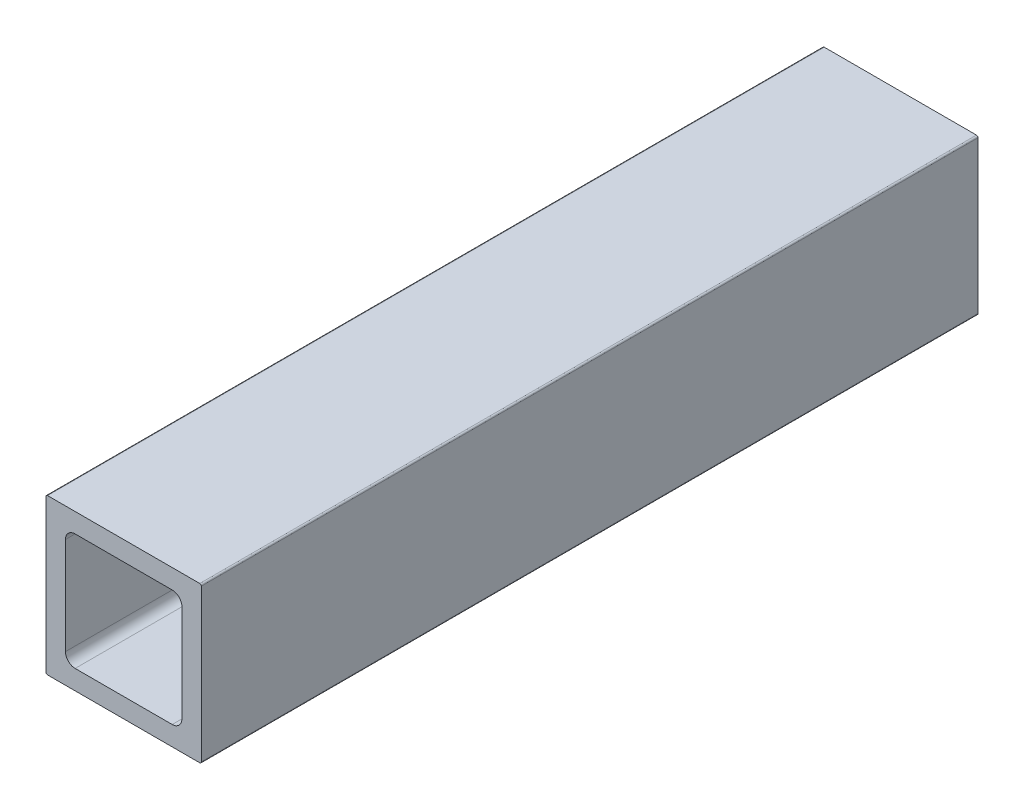
ISO-10303-21;
HEADER;
FILE_DESCRIPTION(('STEP AP214'),'2;1');
FILE_NAME('part.step','',(''),(''),'','','');
FILE_SCHEMA(('AUTOMOTIVE_DESIGN { 1 0 10303 214 1 1 1 1 }'));
ENDSEC;
DATA;
#1=APPLICATION_CONTEXT('core data for automotive mechanical design processes');
#2=APPLICATION_PROTOCOL_DEFINITION('international standard','automotive_design',2000,#1);
#3=PRODUCT_CONTEXT('',#1,'mechanical');
#4=PRODUCT('Part','Part','',(#3));
#5=PRODUCT_RELATED_PRODUCT_CATEGORY('part','',(#4));
#6=PRODUCT_DEFINITION_FORMATION('','',#4);
#7=PRODUCT_DEFINITION_CONTEXT('part definition',#1,'design');
#8=PRODUCT_DEFINITION('design','',#6,#7);
#9=PRODUCT_DEFINITION_SHAPE('','',#8);
#10=(LENGTH_UNIT() NAMED_UNIT(*) SI_UNIT(.MILLI.,.METRE.));
#11=(NAMED_UNIT(*) PLANE_ANGLE_UNIT() SI_UNIT($,.RADIAN.));
#12=(NAMED_UNIT(*) SI_UNIT($,.STERADIAN.) SOLID_ANGLE_UNIT());
#13=UNCERTAINTY_MEASURE_WITH_UNIT(LENGTH_MEASURE(1.E-05),#10,'distance_accuracy_value','');
#14=(GEOMETRIC_REPRESENTATION_CONTEXT(3) GLOBAL_UNCERTAINTY_ASSIGNED_CONTEXT((#13)) GLOBAL_UNIT_ASSIGNED_CONTEXT((#10,
#11,#12)) REPRESENTATION_CONTEXT('',''));
#15=CARTESIAN_POINT('',(0.,0.,0.));
#16=DIRECTION('',(0.,0.,1.));
#17=DIRECTION('',(1.,0.,0.));
#18=AXIS2_PLACEMENT_3D('',#15,#16,#17);
#19=CARTESIAN_POINT('',(3.175,4.7625,1828.8));
#20=DIRECTION('',(1.,0.,0.));
#21=DIRECTION('',(0.,1.,0.));
#22=AXIS2_PLACEMENT_3D('',#19,#20,#21);
#23=PLANE('',#22);
#24=DIRECTION('',(0.,-1.,0.));
#25=VECTOR('',#24,1.);
#26=CARTESIAN_POINT('',(3.175,4.7625,1701.8));
#27=LINE('',#26,#25);
#28=CARTESIAN_POINT('',(3.175,20.6375,1701.8));
#29=VERTEX_POINT('',#28);
#30=CARTESIAN_POINT('',(3.175,4.7625,1701.8));
#31=VERTEX_POINT('',#30);
#32=EDGE_CURVE('E55',#29,#31,#27,.T.);
#33=ORIENTED_EDGE('',*,*,#32,.F.);
#34=DIRECTION('',(0.,0.,-1.));
#35=VECTOR('',#34,1.);
#36=CARTESIAN_POINT('',(3.175,20.6375,1828.8));
#37=LINE('',#36,#35);
#38=CARTESIAN_POINT('',(3.175,20.6375,1828.8));
#39=VERTEX_POINT('',#38);
#40=EDGE_CURVE('E48',#39,#29,#37,.T.);
#41=ORIENTED_EDGE('',*,*,#40,.F.);
#42=DIRECTION('',(0.,-1.,0.));
#43=VECTOR('',#42,1.);
#44=CARTESIAN_POINT('',(3.175,4.7625,1828.8));
#45=LINE('',#44,#43);
#46=CARTESIAN_POINT('',(3.175,4.7625,1828.8));
#47=VERTEX_POINT('',#46);
#48=EDGE_CURVE('E214',#39,#47,#45,.T.);
#49=ORIENTED_EDGE('',*,*,#48,.T.);
#50=DIRECTION('',(0.,0.,-1.));
#51=VECTOR('',#50,1.);
#52=CARTESIAN_POINT('',(3.175,4.7625,1828.8));
#53=LINE('',#52,#51);
#54=EDGE_CURVE('E319',#47,#31,#53,.T.);
#55=ORIENTED_EDGE('',*,*,#54,.T.);
#56=EDGE_LOOP('',(#33,#41,#49,#55));
#57=FACE_BOUND('',#56,.T.);
#58=ADVANCED_FACE('F40',(#57),#23,.T.);
#59=CARTESIAN_POINT('',(4.7625,20.6375,1828.8));
#60=DIRECTION('',(0.,0.,-1.));
#61=DIRECTION('',(-1.,0.,0.));
#62=AXIS2_PLACEMENT_3D('',#59,#60,#61);
#63=CYLINDRICAL_SURFACE('',#62,1.5875);
#64=ORIENTED_EDGE('',*,*,#40,.T.);
#65=CARTESIAN_POINT('',(4.7625,20.6375,1701.8));
#66=DIRECTION('',(0.,0.,1.));
#67=DIRECTION('',(1.,0.,0.));
#68=AXIS2_PLACEMENT_3D('',#65,#66,#67);
#69=CIRCLE('',#68,1.5875);
#70=CARTESIAN_POINT('',(4.7625,22.225,1701.8));
#71=VERTEX_POINT('',#70);
#72=EDGE_CURVE('E299',#29,#71,#69,.F.);
#73=ORIENTED_EDGE('',*,*,#72,.T.);
#74=DIRECTION('',(0.,0.,-1.));
#75=VECTOR('',#74,1.);
#76=CARTESIAN_POINT('',(4.7625,22.225,1828.8));
#77=LINE('',#76,#75);
#78=CARTESIAN_POINT('',(4.7625,22.225,1828.8));
#79=VERTEX_POINT('',#78);
#80=EDGE_CURVE('E287',#79,#71,#77,.T.);
#81=ORIENTED_EDGE('',*,*,#80,.F.);
#82=CARTESIAN_POINT('',(4.7625,20.6375,1828.8));
#83=DIRECTION('',(0.,0.,1.));
#84=DIRECTION('',(-1.,0.,0.));
#85=AXIS2_PLACEMENT_3D('',#82,#83,#84);
#86=CIRCLE('',#85,1.5875);
#87=EDGE_CURVE('E219',#79,#39,#86,.T.);
#88=ORIENTED_EDGE('',*,*,#87,.T.);
#89=EDGE_LOOP('',(#64,#73,#81,#88));
#90=FACE_BOUND('',#89,.T.);
#91=ADVANCED_FACE('F297',(#90),#63,.F.);
#92=CARTESIAN_POINT('',(4.7625,22.225,1828.8));
#93=DIRECTION('',(0.,-1.,0.));
#94=DIRECTION('',(0.,0.,-1.));
#95=AXIS2_PLACEMENT_3D('',#92,#93,#94);
#96=PLANE('',#95);
#97=DIRECTION('',(-1.,0.,0.));
#98=VECTOR('',#97,1.);
#99=CARTESIAN_POINT('',(4.7625,22.225,1701.8));
#100=LINE('',#99,#98);
#101=CARTESIAN_POINT('',(20.6375,22.225,1701.8));
#102=VERTEX_POINT('',#101);
#103=EDGE_CURVE('E332',#102,#71,#100,.T.);
#104=ORIENTED_EDGE('',*,*,#103,.F.);
#105=DIRECTION('',(0.,0.,-1.));
#106=VECTOR('',#105,1.);
#107=CARTESIAN_POINT('',(20.6375,22.225,1828.8));
#108=LINE('',#107,#106);
#109=CARTESIAN_POINT('',(20.6375,22.225,1828.8));
#110=VERTEX_POINT('',#109);
#111=EDGE_CURVE('E234',#110,#102,#108,.T.);
#112=ORIENTED_EDGE('',*,*,#111,.F.);
#113=DIRECTION('',(-1.,0.,0.));
#114=VECTOR('',#113,1.);
#115=CARTESIAN_POINT('',(4.7625,22.225,1828.8));
#116=LINE('',#115,#114);
#117=EDGE_CURVE('E223',#110,#79,#116,.T.);
#118=ORIENTED_EDGE('',*,*,#117,.T.);
#119=ORIENTED_EDGE('',*,*,#80,.T.);
#120=EDGE_LOOP('',(#104,#112,#118,#119));
#121=FACE_BOUND('',#120,.T.);
#122=ADVANCED_FACE('F286',(#121),#96,.T.);
#123=CARTESIAN_POINT('',(20.6375,20.6375,1828.8));
#124=DIRECTION('',(0.,0.,-1.));
#125=DIRECTION('',(-1.,0.,0.));
#126=AXIS2_PLACEMENT_3D('',#123,#124,#125);
#127=CYLINDRICAL_SURFACE('',#126,1.5875);
#128=ORIENTED_EDGE('',*,*,#111,.T.);
#129=CARTESIAN_POINT('',(20.6375,20.6375,1701.8));
#130=DIRECTION('',(0.,0.,1.));
#131=DIRECTION('',(1.,0.,0.));
#132=AXIS2_PLACEMENT_3D('',#129,#130,#131);
#133=CIRCLE('',#132,1.5875);
#134=CARTESIAN_POINT('',(22.225,20.6375,1701.8));
#135=VERTEX_POINT('',#134);
#136=EDGE_CURVE('E334',#102,#135,#133,.F.);
#137=ORIENTED_EDGE('',*,*,#136,.T.);
#138=DIRECTION('',(0.,0.,-1.));
#139=VECTOR('',#138,1.);
#140=CARTESIAN_POINT('',(22.225,20.6375,1828.8));
#141=LINE('',#140,#139);
#142=CARTESIAN_POINT('',(22.225,20.6375,1828.8));
#143=VERTEX_POINT('',#142);
#144=EDGE_CURVE('E230',#143,#135,#141,.T.);
#145=ORIENTED_EDGE('',*,*,#144,.F.);
#146=CARTESIAN_POINT('',(20.6375,20.6375,1828.8));
#147=DIRECTION('',(0.,0.,1.));
#148=DIRECTION('',(-1.,0.,0.));
#149=AXIS2_PLACEMENT_3D('',#146,#147,#148);
#150=CIRCLE('',#149,1.5875);
#151=EDGE_CURVE('E209',#143,#110,#150,.T.);
#152=ORIENTED_EDGE('',*,*,#151,.T.);
#153=EDGE_LOOP('',(#128,#137,#145,#152));
#154=FACE_BOUND('',#153,.T.);
#155=ADVANCED_FACE('F489',(#154),#127,.F.);
#156=CARTESIAN_POINT('',(22.225,4.7625,1828.8));
#157=DIRECTION('',(-1.,0.,0.));
#158=DIRECTION('',(0.,0.,1.));
#159=AXIS2_PLACEMENT_3D('',#156,#157,#158);
#160=PLANE('',#159);
#161=DIRECTION('',(0.,1.,0.));
#162=VECTOR('',#161,1.);
#163=CARTESIAN_POINT('',(22.225,4.7625,1701.8));
#164=LINE('',#163,#162);
#165=CARTESIAN_POINT('',(22.225,4.7625,1701.8));
#166=VERTEX_POINT('',#165);
#167=EDGE_CURVE('E337',#166,#135,#164,.T.);
#168=ORIENTED_EDGE('',*,*,#167,.F.);
#169=DIRECTION('',(0.,0.,-1.));
#170=VECTOR('',#169,1.);
#171=CARTESIAN_POINT('',(22.225,4.7625,1828.8));
#172=LINE('',#171,#170);
#173=CARTESIAN_POINT('',(22.225,4.7625,1828.8));
#174=VERTEX_POINT('',#173);
#175=EDGE_CURVE('E235',#174,#166,#172,.T.);
#176=ORIENTED_EDGE('',*,*,#175,.F.);
#177=DIRECTION('',(0.,1.,0.));
#178=VECTOR('',#177,1.);
#179=CARTESIAN_POINT('',(22.225,4.7625,1828.8));
#180=LINE('',#179,#178);
#181=EDGE_CURVE('E205',#174,#143,#180,.T.);
#182=ORIENTED_EDGE('',*,*,#181,.T.);
#183=ORIENTED_EDGE('',*,*,#144,.T.);
#184=EDGE_LOOP('',(#168,#176,#182,#183));
#185=FACE_BOUND('',#184,.T.);
#186=ADVANCED_FACE('F388',(#185),#160,.T.);
#187=CARTESIAN_POINT('',(20.6375,4.7625,1828.8));
#188=DIRECTION('',(0.,0.,-1.));
#189=DIRECTION('',(-1.,0.,0.));
#190=AXIS2_PLACEMENT_3D('',#187,#188,#189);
#191=CYLINDRICAL_SURFACE('',#190,1.5875);
#192=ORIENTED_EDGE('',*,*,#175,.T.);
#193=CARTESIAN_POINT('',(20.6375,4.7625,1701.8));
#194=DIRECTION('',(0.,0.,1.));
#195=DIRECTION('',(1.,0.,0.));
#196=AXIS2_PLACEMENT_3D('',#193,#194,#195);
#197=CIRCLE('',#196,1.5875);
#198=CARTESIAN_POINT('',(20.6375,3.175,1701.8));
#199=VERTEX_POINT('',#198);
#200=EDGE_CURVE('E339',#166,#199,#197,.F.);
#201=ORIENTED_EDGE('',*,*,#200,.T.);
#202=DIRECTION('',(0.,0.,-1.));
#203=VECTOR('',#202,1.);
#204=CARTESIAN_POINT('',(20.6375,3.175,1828.8));
#205=LINE('',#204,#203);
#206=CARTESIAN_POINT('',(20.6375,3.175,1828.8));
#207=VERTEX_POINT('',#206);
#208=EDGE_CURVE('E261',#207,#199,#205,.T.);
#209=ORIENTED_EDGE('',*,*,#208,.F.);
#210=CARTESIAN_POINT('',(20.6375,4.7625,1828.8));
#211=DIRECTION('',(0.,0.,1.));
#212=DIRECTION('',(-1.,0.,0.));
#213=AXIS2_PLACEMENT_3D('',#210,#211,#212);
#214=CIRCLE('',#213,1.5875);
#215=EDGE_CURVE('E208',#207,#174,#214,.T.);
#216=ORIENTED_EDGE('',*,*,#215,.T.);
#217=EDGE_LOOP('',(#192,#201,#209,#216));
#218=FACE_BOUND('',#217,.T.);
#219=ADVANCED_FACE('F385',(#218),#191,.F.);
#220=CARTESIAN_POINT('',(4.7625,3.175,1828.8));
#221=DIRECTION('',(0.,1.,0.));
#222=DIRECTION('',(1.,0.,0.));
#223=AXIS2_PLACEMENT_3D('',#220,#221,#222);
#224=PLANE('',#223);
#225=DIRECTION('',(1.,0.,0.));
#226=VECTOR('',#225,1.);
#227=CARTESIAN_POINT('',(4.7625,3.175,1701.8));
#228=LINE('',#227,#226);
#229=CARTESIAN_POINT('',(4.7625,3.175,1701.8));
#230=VERTEX_POINT('',#229);
#231=EDGE_CURVE('E342',#230,#199,#228,.T.);
#232=ORIENTED_EDGE('',*,*,#231,.F.);
#233=DIRECTION('',(0.,0.,-1.));
#234=VECTOR('',#233,1.);
#235=CARTESIAN_POINT('',(4.7625,3.175,1828.8));
#236=LINE('',#235,#234);
#237=CARTESIAN_POINT('',(4.7625,3.175,1828.8));
#238=VERTEX_POINT('',#237);
#239=EDGE_CURVE('E265',#238,#230,#236,.T.);
#240=ORIENTED_EDGE('',*,*,#239,.F.);
#241=DIRECTION('',(1.,0.,0.));
#242=VECTOR('',#241,1.);
#243=CARTESIAN_POINT('',(4.7625,3.175,1828.8));
#244=LINE('',#243,#242);
#245=EDGE_CURVE('E251',#238,#207,#244,.T.);
#246=ORIENTED_EDGE('',*,*,#245,.T.);
#247=ORIENTED_EDGE('',*,*,#208,.T.);
#248=EDGE_LOOP('',(#232,#240,#246,#247));
#249=FACE_BOUND('',#248,.T.);
#250=ADVANCED_FACE('F387',(#249),#224,.T.);
#251=CARTESIAN_POINT('',(4.7625,4.7625,1828.8));
#252=DIRECTION('',(0.,0.,-1.));
#253=DIRECTION('',(-1.,0.,0.));
#254=AXIS2_PLACEMENT_3D('',#251,#252,#253);
#255=CYLINDRICAL_SURFACE('',#254,1.5875);
#256=ORIENTED_EDGE('',*,*,#239,.T.);
#257=CARTESIAN_POINT('',(4.7625,4.7625,1701.8));
#258=DIRECTION('',(0.,0.,1.));
#259=DIRECTION('',(1.,0.,0.));
#260=AXIS2_PLACEMENT_3D('',#257,#258,#259);
#261=CIRCLE('',#260,1.5875);
#262=EDGE_CURVE('E344',#230,#31,#261,.F.);
#263=ORIENTED_EDGE('',*,*,#262,.T.);
#264=ORIENTED_EDGE('',*,*,#54,.F.);
#265=CARTESIAN_POINT('',(4.7625,4.7625,1828.8));
#266=DIRECTION('',(0.,0.,1.));
#267=DIRECTION('',(1.,0.,0.));
#268=AXIS2_PLACEMENT_3D('',#265,#266,#267);
#269=CIRCLE('',#268,1.5875);
#270=EDGE_CURVE('E210',#47,#238,#269,.T.);
#271=ORIENTED_EDGE('',*,*,#270,.T.);
#272=EDGE_LOOP('',(#256,#263,#264,#271));
#273=FACE_BOUND('',#272,.T.);
#274=ADVANCED_FACE('F423',(#273),#255,.F.);
#275=CARTESIAN_POINT('',(0.,0.254,1828.8));
#276=DIRECTION('',(1.,0.,0.));
#277=DIRECTION('',(0.,1.,0.));
#278=AXIS2_PLACEMENT_3D('',#275,#276,#277);
#279=PLANE('',#278);
#280=DIRECTION('',(0.,0.,-1.));
#281=VECTOR('',#280,1.);
#282=CARTESIAN_POINT('',(0.,25.146,1828.8));
#283=LINE('',#282,#281);
#284=CARTESIAN_POINT('',(0.,25.146,1828.8));
#285=VERTEX_POINT('',#284);
#286=CARTESIAN_POINT('',(0.,25.146,1701.8));
#287=VERTEX_POINT('',#286);
#288=EDGE_CURVE('E260',#285,#287,#283,.T.);
#289=ORIENTED_EDGE('',*,*,#288,.T.);
#290=DIRECTION('',(0.,-1.,0.));
#291=VECTOR('',#290,1.);
#292=CARTESIAN_POINT('',(0.,0.254,1701.8));
#293=LINE('',#292,#291);
#294=CARTESIAN_POINT('',(0.,0.254,1701.8));
#295=VERTEX_POINT('',#294);
#296=EDGE_CURVE('E182',#287,#295,#293,.T.);
#297=ORIENTED_EDGE('',*,*,#296,.T.);
#298=DIRECTION('',(0.,0.,-1.));
#299=VECTOR('',#298,1.);
#300=CARTESIAN_POINT('',(0.,0.254,1828.8));
#301=LINE('',#300,#299);
#302=CARTESIAN_POINT('',(0.,0.254,1828.8));
#303=VERTEX_POINT('',#302);
#304=EDGE_CURVE('E191',#303,#295,#301,.T.);
#305=ORIENTED_EDGE('',*,*,#304,.F.);
#306=DIRECTION('',(0.,-1.,0.));
#307=VECTOR('',#306,1.);
#308=CARTESIAN_POINT('',(0.,0.254,1828.8));
#309=LINE('',#308,#307);
#310=EDGE_CURVE('E215',#285,#303,#309,.T.);
#311=ORIENTED_EDGE('',*,*,#310,.F.);
#312=EDGE_LOOP('',(#289,#297,#305,#311));
#313=FACE_BOUND('',#312,.T.);
#314=ADVANCED_FACE('F417',(#313),#279,.F.);
#315=CARTESIAN_POINT('',(0.254,25.146,1828.8));
#316=DIRECTION('',(0.,0.,-1.));
#317=DIRECTION('',(-1.,0.,0.));
#318=AXIS2_PLACEMENT_3D('',#315,#316,#317);
#319=CYLINDRICAL_SURFACE('',#318,0.254);
#320=CARTESIAN_POINT('',(0.254,25.146,1701.8));
#321=DIRECTION('',(0.,0.,1.));
#322=DIRECTION('',(1.,0.,0.));
#323=AXIS2_PLACEMENT_3D('',#320,#321,#322);
#324=CIRCLE('',#323,0.254);
#325=CARTESIAN_POINT('',(0.254000000000004,25.4,1701.8));
#326=VERTEX_POINT('',#325);
#327=EDGE_CURVE('E173',#287,#326,#324,.F.);
#328=ORIENTED_EDGE('',*,*,#327,.F.);
#329=ORIENTED_EDGE('',*,*,#288,.F.);
#330=CARTESIAN_POINT('',(0.254,25.146,1828.8));
#331=DIRECTION('',(0.,0.,1.));
#332=DIRECTION('',(-1.,0.,0.));
#333=AXIS2_PLACEMENT_3D('',#330,#331,#332);
#334=CIRCLE('',#333,0.254);
#335=CARTESIAN_POINT('',(0.254,25.4,1828.8));
#336=VERTEX_POINT('',#335);
#337=EDGE_CURVE('E236',#336,#285,#334,.T.);
#338=ORIENTED_EDGE('',*,*,#337,.F.);
#339=DIRECTION('',(0.,0.,-1.));
#340=VECTOR('',#339,1.);
#341=CARTESIAN_POINT('',(0.254,25.4,1828.8));
#342=LINE('',#341,#340);
#343=EDGE_CURVE('E256',#336,#326,#342,.T.);
#344=ORIENTED_EDGE('',*,*,#343,.T.);
#345=EDGE_LOOP('',(#328,#329,#338,#344));
#346=FACE_BOUND('',#345,.T.);
#347=ADVANCED_FACE('F422',(#346),#319,.T.);
#348=CARTESIAN_POINT('',(0.254,25.4,1828.8));
#349=DIRECTION('',(0.,-1.,0.));
#350=DIRECTION('',(0.,0.,-1.));
#351=AXIS2_PLACEMENT_3D('',#348,#349,#350);
#352=PLANE('',#351);
#353=DIRECTION('',(0.,0.,-1.));
#354=VECTOR('',#353,1.);
#355=CARTESIAN_POINT('',(25.146,25.4,1828.8));
#356=LINE('',#355,#354);
#357=CARTESIAN_POINT('',(25.146,25.4,1828.8));
#358=VERTEX_POINT('',#357);
#359=CARTESIAN_POINT('',(25.146,25.4,1701.8));
#360=VERTEX_POINT('',#359);
#361=EDGE_CURVE('E252',#358,#360,#356,.T.);
#362=ORIENTED_EDGE('',*,*,#361,.T.);
#363=DIRECTION('',(1.,0.,0.));
#364=VECTOR('',#363,1.);
#365=CARTESIAN_POINT('',(-135.222379220066,25.4,1701.8));
#366=LINE('',#365,#364);
#367=EDGE_CURVE('E183',#326,#360,#366,.T.);
#368=ORIENTED_EDGE('',*,*,#367,.F.);
#369=ORIENTED_EDGE('',*,*,#343,.F.);
#370=DIRECTION('',(-1.,0.,0.));
#371=VECTOR('',#370,1.);
#372=CARTESIAN_POINT('',(0.254,25.4,1828.8));
#373=LINE('',#372,#371);
#374=EDGE_CURVE('E228',#358,#336,#373,.T.);
#375=ORIENTED_EDGE('',*,*,#374,.F.);
#376=EDGE_LOOP('',(#362,#368,#369,#375));
#377=FACE_BOUND('',#376,.T.);
#378=ADVANCED_FACE('F359',(#377),#352,.F.);
#379=CARTESIAN_POINT('',(25.146,25.146,1828.8));
#380=DIRECTION('',(0.,0.,-1.));
#381=DIRECTION('',(-1.,0.,0.));
#382=AXIS2_PLACEMENT_3D('',#379,#380,#381);
#383=CYLINDRICAL_SURFACE('',#382,0.254);
#384=CARTESIAN_POINT('',(25.146,25.146,1701.8));
#385=DIRECTION('',(0.,0.,1.));
#386=DIRECTION('',(1.,0.,0.));
#387=AXIS2_PLACEMENT_3D('',#384,#385,#386);
#388=CIRCLE('',#387,0.254);
#389=CARTESIAN_POINT('',(25.4,25.146,1701.8));
#390=VERTEX_POINT('',#389);
#391=EDGE_CURVE('E346',#360,#390,#388,.F.);
#392=ORIENTED_EDGE('',*,*,#391,.F.);
#393=ORIENTED_EDGE('',*,*,#361,.F.);
#394=CARTESIAN_POINT('',(25.146,25.146,1828.8));
#395=DIRECTION('',(0.,0.,1.));
#396=DIRECTION('',(-1.,0.,0.));
#397=AXIS2_PLACEMENT_3D('',#394,#395,#396);
#398=CIRCLE('',#397,0.254);
#399=CARTESIAN_POINT('',(25.4,25.146,1828.8));
#400=VERTEX_POINT('',#399);
#401=EDGE_CURVE('E224',#400,#358,#398,.T.);
#402=ORIENTED_EDGE('',*,*,#401,.F.);
#403=DIRECTION('',(0.,0.,-1.));
#404=VECTOR('',#403,1.);
#405=CARTESIAN_POINT('',(25.4,25.146,1828.8));
#406=LINE('',#405,#404);
#407=EDGE_CURVE('E197',#400,#390,#406,.T.);
#408=ORIENTED_EDGE('',*,*,#407,.T.);
#409=EDGE_LOOP('',(#392,#393,#402,#408));
#410=FACE_BOUND('',#409,.T.);
#411=ADVANCED_FACE('F42',(#410),#383,.T.);
#412=CARTESIAN_POINT('',(25.4,0.254,1828.8));
#413=DIRECTION('',(-1.,0.,0.));
#414=DIRECTION('',(0.,0.,1.));
#415=AXIS2_PLACEMENT_3D('',#412,#413,#414);
#416=PLANE('',#415);
#417=DIRECTION('',(0.,0.,-1.));
#418=VECTOR('',#417,1.);
#419=CARTESIAN_POINT('',(25.4,0.254,1828.8));
#420=LINE('',#419,#418);
#421=CARTESIAN_POINT('',(25.4,0.254,1828.8));
#422=VERTEX_POINT('',#421);
#423=CARTESIAN_POINT('',(25.4,0.254,1701.8));
#424=VERTEX_POINT('',#423);
#425=EDGE_CURVE('E190',#422,#424,#420,.T.);
#426=ORIENTED_EDGE('',*,*,#425,.T.);
#427=DIRECTION('',(0.,1.,0.));
#428=VECTOR('',#427,1.);
#429=CARTESIAN_POINT('',(25.4,0.254,1701.8));
#430=LINE('',#429,#428);
#431=EDGE_CURVE('E169',#424,#390,#430,.T.);
#432=ORIENTED_EDGE('',*,*,#431,.T.);
#433=ORIENTED_EDGE('',*,*,#407,.F.);
#434=DIRECTION('',(0.,1.,0.));
#435=VECTOR('',#434,1.);
#436=CARTESIAN_POINT('',(25.4,0.254,1828.8));
#437=LINE('',#436,#435);
#438=EDGE_CURVE('E229',#422,#400,#437,.T.);
#439=ORIENTED_EDGE('',*,*,#438,.F.);
#440=EDGE_LOOP('',(#426,#432,#433,#439));
#441=FACE_BOUND('',#440,.T.);
#442=ADVANCED_FACE('F363',(#441),#416,.F.);
#443=CARTESIAN_POINT('',(25.146,0.254,1828.8));
#444=DIRECTION('',(0.,0.,-1.));
#445=DIRECTION('',(-1.,0.,0.));
#446=AXIS2_PLACEMENT_3D('',#443,#444,#445);
#447=CYLINDRICAL_SURFACE('',#446,0.254);
#448=CARTESIAN_POINT('',(25.146,0.254,1701.8));
#449=DIRECTION('',(0.,0.,1.));
#450=DIRECTION('',(1.,0.,0.));
#451=AXIS2_PLACEMENT_3D('',#448,#449,#450);
#452=CIRCLE('',#451,0.254);
#453=CARTESIAN_POINT('',(25.146,0.,1701.8));
#454=VERTEX_POINT('',#453);
#455=EDGE_CURVE('E166',#424,#454,#452,.F.);
#456=ORIENTED_EDGE('',*,*,#455,.F.);
#457=ORIENTED_EDGE('',*,*,#425,.F.);
#458=CARTESIAN_POINT('',(25.146,0.254,1828.8));
#459=DIRECTION('',(0.,0.,1.));
#460=DIRECTION('',(1.,0.,0.));
#461=AXIS2_PLACEMENT_3D('',#458,#459,#460);
#462=CIRCLE('',#461,0.254);
#463=CARTESIAN_POINT('',(25.146,0.,1828.8));
#464=VERTEX_POINT('',#463);
#465=EDGE_CURVE('E187',#464,#422,#462,.T.);
#466=ORIENTED_EDGE('',*,*,#465,.F.);
#467=DIRECTION('',(0.,0.,-1.));
#468=VECTOR('',#467,1.);
#469=CARTESIAN_POINT('',(25.146,0.,1828.8));
#470=LINE('',#469,#468);
#471=EDGE_CURVE('E179',#464,#454,#470,.T.);
#472=ORIENTED_EDGE('',*,*,#471,.T.);
#473=EDGE_LOOP('',(#456,#457,#466,#472));
#474=FACE_BOUND('',#473,.T.);
#475=ADVANCED_FACE('F185',(#474),#447,.T.);
#476=CARTESIAN_POINT('',(0.254,0.,1828.8));
#477=DIRECTION('',(0.,1.,0.));
#478=DIRECTION('',(1.,0.,0.));
#479=AXIS2_PLACEMENT_3D('',#476,#477,#478);
#480=PLANE('',#479);
#481=DIRECTION('',(0.,0.,-1.));
#482=VECTOR('',#481,1.);
#483=CARTESIAN_POINT('',(0.254,0.,1828.8));
#484=LINE('',#483,#482);
#485=CARTESIAN_POINT('',(0.254,0.,1828.8));
#486=VERTEX_POINT('',#485);
#487=CARTESIAN_POINT('',(0.254,0.,1701.8));
#488=VERTEX_POINT('',#487);
#489=EDGE_CURVE('E181',#486,#488,#484,.T.);
#490=ORIENTED_EDGE('',*,*,#489,.T.);
#491=DIRECTION('',(-1.,0.,0.));
#492=VECTOR('',#491,1.);
#493=CARTESIAN_POINT('',(-135.222379220066,0.,1701.8));
#494=LINE('',#493,#492);
#495=EDGE_CURVE('E62',#454,#488,#494,.T.);
#496=ORIENTED_EDGE('',*,*,#495,.F.);
#497=ORIENTED_EDGE('',*,*,#471,.F.);
#498=DIRECTION('',(1.,0.,0.));
#499=VECTOR('',#498,1.);
#500=CARTESIAN_POINT('',(0.254,0.,1828.8));
#501=LINE('',#500,#499);
#502=EDGE_CURVE('E245',#486,#464,#501,.T.);
#503=ORIENTED_EDGE('',*,*,#502,.F.);
#504=EDGE_LOOP('',(#490,#496,#497,#503));
#505=FACE_BOUND('',#504,.T.);
#506=ADVANCED_FACE('F177',(#505),#480,.F.);
#507=CARTESIAN_POINT('',(0.254,0.254,1828.8));
#508=DIRECTION('',(0.,0.,-1.));
#509=DIRECTION('',(-1.,0.,0.));
#510=AXIS2_PLACEMENT_3D('',#507,#508,#509);
#511=CYLINDRICAL_SURFACE('',#510,0.254);
#512=CARTESIAN_POINT('',(0.254,0.254,1701.8));
#513=DIRECTION('',(0.,0.,1.));
#514=DIRECTION('',(1.,0.,0.));
#515=AXIS2_PLACEMENT_3D('',#512,#513,#514);
#516=CIRCLE('',#515,0.254);
#517=EDGE_CURVE('E11',#488,#295,#516,.F.);
#518=ORIENTED_EDGE('',*,*,#517,.F.);
#519=ORIENTED_EDGE('',*,*,#489,.F.);
#520=CARTESIAN_POINT('',(0.254,0.254,1828.8));
#521=DIRECTION('',(0.,0.,1.));
#522=DIRECTION('',(-1.,0.,0.));
#523=AXIS2_PLACEMENT_3D('',#520,#521,#522);
#524=CIRCLE('',#523,0.254);
#525=EDGE_CURVE('E248',#303,#486,#524,.T.);
#526=ORIENTED_EDGE('',*,*,#525,.F.);
#527=ORIENTED_EDGE('',*,*,#304,.T.);
#528=EDGE_LOOP('',(#518,#519,#526,#527));
#529=FACE_BOUND('',#528,.T.);
#530=ADVANCED_FACE('F381',(#529),#511,.T.);
#531=CARTESIAN_POINT('',(0.254,0.254,1828.8));
#532=DIRECTION('',(0.,0.,-1.));
#533=DIRECTION('',(0.,-1.,0.));
#534=AXIS2_PLACEMENT_3D('',#531,#532,#533);
#535=PLANE('',#534);
#536=ORIENTED_EDGE('',*,*,#270,.F.);
#537=ORIENTED_EDGE('',*,*,#48,.F.);
#538=ORIENTED_EDGE('',*,*,#87,.F.);
#539=ORIENTED_EDGE('',*,*,#117,.F.);
#540=ORIENTED_EDGE('',*,*,#151,.F.);
#541=ORIENTED_EDGE('',*,*,#181,.F.);
#542=ORIENTED_EDGE('',*,*,#215,.F.);
#543=ORIENTED_EDGE('',*,*,#245,.F.);
#544=EDGE_LOOP('',(#536,#537,#538,#539,#540,#541,#542,#543));
#545=FACE_BOUND('',#544,.T.);
#546=ORIENTED_EDGE('',*,*,#525,.T.);
#547=ORIENTED_EDGE('',*,*,#502,.T.);
#548=ORIENTED_EDGE('',*,*,#465,.T.);
#549=ORIENTED_EDGE('',*,*,#438,.T.);
#550=ORIENTED_EDGE('',*,*,#401,.T.);
#551=ORIENTED_EDGE('',*,*,#374,.T.);
#552=ORIENTED_EDGE('',*,*,#337,.T.);
#553=ORIENTED_EDGE('',*,*,#310,.T.);
#554=EDGE_LOOP('',(#546,#547,#548,#549,#550,#551,#552,#553));
#555=FACE_BOUND('',#554,.T.);
#556=ADVANCED_FACE('F293',(#545,#555),#535,.F.);
#557=CARTESIAN_POINT('',(-135.222379220066,-1723.13883427537,1701.8));
#558=DIRECTION('',(0.,0.,1.));
#559=DIRECTION('',(1.,0.,0.));
#560=AXIS2_PLACEMENT_3D('',#557,#558,#559);
#561=PLANE('',#560);
#562=ORIENTED_EDGE('',*,*,#32,.T.);
#563=ORIENTED_EDGE('',*,*,#262,.F.);
#564=ORIENTED_EDGE('',*,*,#231,.T.);
#565=ORIENTED_EDGE('',*,*,#200,.F.);
#566=ORIENTED_EDGE('',*,*,#167,.T.);
#567=ORIENTED_EDGE('',*,*,#136,.F.);
#568=ORIENTED_EDGE('',*,*,#103,.T.);
#569=ORIENTED_EDGE('',*,*,#72,.F.);
#570=EDGE_LOOP('',(#562,#563,#564,#565,#566,#567,#568,#569));
#571=FACE_BOUND('',#570,.T.);
#572=ORIENTED_EDGE('',*,*,#391,.T.);
#573=ORIENTED_EDGE('',*,*,#431,.F.);
#574=ORIENTED_EDGE('',*,*,#455,.T.);
#575=ORIENTED_EDGE('',*,*,#495,.T.);
#576=ORIENTED_EDGE('',*,*,#517,.T.);
#577=ORIENTED_EDGE('',*,*,#296,.F.);
#578=ORIENTED_EDGE('',*,*,#327,.T.);
#579=ORIENTED_EDGE('',*,*,#367,.T.);
#580=EDGE_LOOP('',(#572,#573,#574,#575,#576,#577,#578,#579));
#581=FACE_BOUND('',#580,.T.);
#582=ADVANCED_FACE('F167',(#571,#581),#561,.F.);
#583=CLOSED_SHELL('',(#58,#91,#122,#155,#186,#219,#250,#274,#314,#347,#378,#411,#442,#475,#506,
#530,#556,#582));
#584=MANIFOLD_SOLID_BREP('B2',#583);
#585=ADVANCED_BREP_SHAPE_REPRESENTATION('',(#18,#584),#14);
#586=SHAPE_DEFINITION_REPRESENTATION(#9,#585);
ENDSEC;
END-ISO-10303-21;
